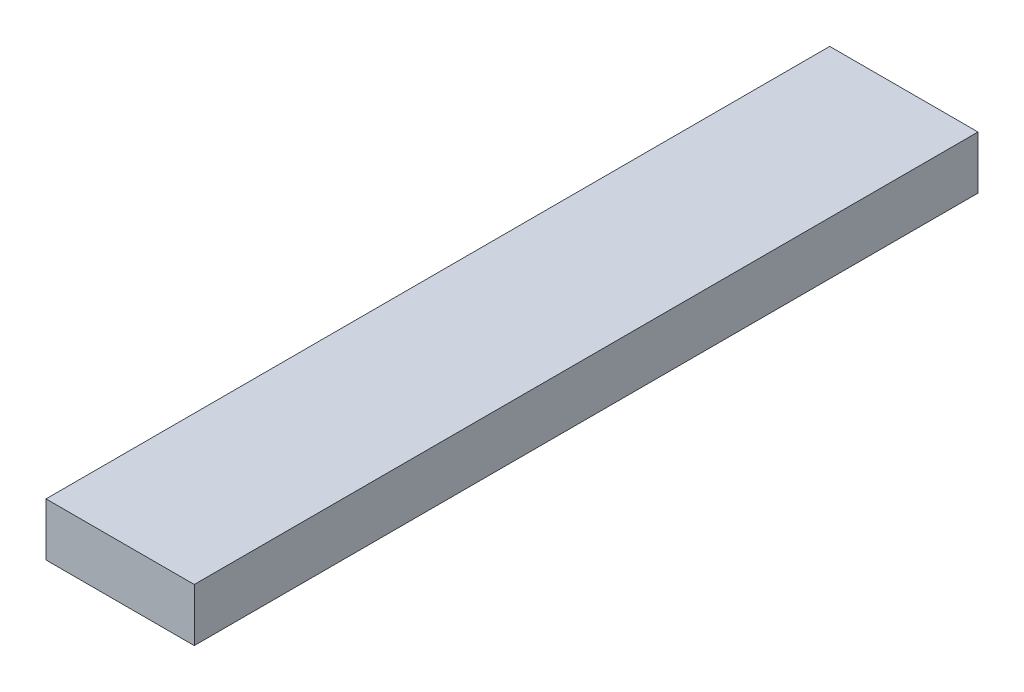
ISO-10303-21;
HEADER;
FILE_DESCRIPTION(('STEP AP214'),'2;1');
FILE_NAME('part.step','',(''),(''),'','','');
FILE_SCHEMA(('AUTOMOTIVE_DESIGN { 1 0 10303 214 1 1 1 1 }'));
ENDSEC;
DATA;
#1=APPLICATION_CONTEXT('core data for automotive mechanical design processes');
#2=APPLICATION_PROTOCOL_DEFINITION('international standard','automotive_design',2000,#1);
#3=PRODUCT_CONTEXT('',#1,'mechanical');
#4=PRODUCT('Part','Part','',(#3));
#5=PRODUCT_RELATED_PRODUCT_CATEGORY('part','',(#4));
#6=PRODUCT_DEFINITION_FORMATION('','',#4);
#7=PRODUCT_DEFINITION_CONTEXT('part definition',#1,'design');
#8=PRODUCT_DEFINITION('design','',#6,#7);
#9=PRODUCT_DEFINITION_SHAPE('','',#8);
#10=(LENGTH_UNIT() NAMED_UNIT(*) SI_UNIT(.MILLI.,.METRE.));
#11=(NAMED_UNIT(*) PLANE_ANGLE_UNIT() SI_UNIT($,.RADIAN.));
#12=(NAMED_UNIT(*) SI_UNIT($,.STERADIAN.) SOLID_ANGLE_UNIT());
#13=UNCERTAINTY_MEASURE_WITH_UNIT(LENGTH_MEASURE(1.E-05),#10,'distance_accuracy_value','');
#14=(GEOMETRIC_REPRESENTATION_CONTEXT(3) GLOBAL_UNCERTAINTY_ASSIGNED_CONTEXT((#13)) GLOBAL_UNIT_ASSIGNED_CONTEXT((#10,
#11,#12)) REPRESENTATION_CONTEXT('',''));
#15=CARTESIAN_POINT('',(0.,0.,0.));
#16=DIRECTION('',(0.,0.,1.));
#17=DIRECTION('',(1.,0.,0.));
#18=AXIS2_PLACEMENT_3D('',#15,#16,#17);
#19=CARTESIAN_POINT('',(0.,5.,0.));
#20=DIRECTION('',(1.,0.,0.));
#21=DIRECTION('',(0.,0.,-1.));
#22=AXIS2_PLACEMENT_3D('',#19,#20,#21);
#23=PLANE('',#22);
#24=DIRECTION('',(0.,0.,1.));
#25=VECTOR('',#24,1.);
#26=CARTESIAN_POINT('',(0.,0.,0.));
#27=LINE('',#26,#25);
#28=CARTESIAN_POINT('',(0.,0.,-74.));
#29=VERTEX_POINT('',#28);
#30=CARTESIAN_POINT('',(0.,0.,0.));
#31=VERTEX_POINT('',#30);
#32=EDGE_CURVE('E107',#29,#31,#27,.T.);
#33=ORIENTED_EDGE('',*,*,#32,.T.);
#34=DIRECTION('',(0.,-1.,0.));
#35=VECTOR('',#34,1.);
#36=CARTESIAN_POINT('',(0.,5.,0.));
#37=LINE('',#36,#35);
#38=CARTESIAN_POINT('',(0.,5.,0.));
#39=VERTEX_POINT('',#38);
#40=EDGE_CURVE('E11',#39,#31,#37,.T.);
#41=ORIENTED_EDGE('',*,*,#40,.F.);
#42=DIRECTION('',(0.,0.,1.));
#43=VECTOR('',#42,1.);
#44=CARTESIAN_POINT('',(0.,5.,0.));
#45=LINE('',#44,#43);
#46=CARTESIAN_POINT('',(0.,5.,-74.));
#47=VERTEX_POINT('',#46);
#48=EDGE_CURVE('E91',#47,#39,#45,.T.);
#49=ORIENTED_EDGE('',*,*,#48,.F.);
#50=DIRECTION('',(0.,-1.,0.));
#51=VECTOR('',#50,1.);
#52=CARTESIAN_POINT('',(0.,5.,-74.));
#53=LINE('',#52,#51);
#54=EDGE_CURVE('E103',#47,#29,#53,.T.);
#55=ORIENTED_EDGE('',*,*,#54,.T.);
#56=EDGE_LOOP('',(#33,#41,#49,#55));
#57=FACE_BOUND('',#56,.T.);
#58=ADVANCED_FACE('F39',(#57),#23,.F.);
#59=CARTESIAN_POINT('',(0.,5.,0.));
#60=DIRECTION('',(0.,0.,-1.));
#61=DIRECTION('',(-1.,0.,0.));
#62=AXIS2_PLACEMENT_3D('',#59,#60,#61);
#63=PLANE('',#62);
#64=DIRECTION('',(1.,0.,0.));
#65=VECTOR('',#64,1.);
#66=CARTESIAN_POINT('',(0.,0.,0.));
#67=LINE('',#66,#65);
#68=CARTESIAN_POINT('',(14.,0.,0.));
#69=VERTEX_POINT('',#68);
#70=EDGE_CURVE('E96',#31,#69,#67,.T.);
#71=ORIENTED_EDGE('',*,*,#70,.T.);
#72=DIRECTION('',(0.,-1.,0.));
#73=VECTOR('',#72,1.);
#74=CARTESIAN_POINT('',(14.,5.,0.));
#75=LINE('',#74,#73);
#76=CARTESIAN_POINT('',(14.,5.,0.));
#77=VERTEX_POINT('',#76);
#78=EDGE_CURVE('E48',#77,#69,#75,.T.);
#79=ORIENTED_EDGE('',*,*,#78,.F.);
#80=DIRECTION('',(1.,0.,0.));
#81=VECTOR('',#80,1.);
#82=CARTESIAN_POINT('',(0.,5.,0.));
#83=LINE('',#82,#81);
#84=EDGE_CURVE('E86',#39,#77,#83,.T.);
#85=ORIENTED_EDGE('',*,*,#84,.F.);
#86=ORIENTED_EDGE('',*,*,#40,.T.);
#87=EDGE_LOOP('',(#71,#79,#85,#86));
#88=FACE_BOUND('',#87,.T.);
#89=ADVANCED_FACE('F95',(#88),#63,.F.);
#90=CARTESIAN_POINT('',(14.,5.,0.));
#91=DIRECTION('',(-1.,0.,0.));
#92=DIRECTION('',(0.,0.,1.));
#93=AXIS2_PLACEMENT_3D('',#90,#91,#92);
#94=PLANE('',#93);
#95=DIRECTION('',(0.,0.,-1.));
#96=VECTOR('',#95,1.);
#97=CARTESIAN_POINT('',(14.,0.,0.));
#98=LINE('',#97,#96);
#99=CARTESIAN_POINT('',(14.,0.,-74.));
#100=VERTEX_POINT('',#99);
#101=EDGE_CURVE('E73',#69,#100,#98,.T.);
#102=ORIENTED_EDGE('',*,*,#101,.T.);
#103=DIRECTION('',(0.,-1.,0.));
#104=VECTOR('',#103,1.);
#105=CARTESIAN_POINT('',(14.,5.,-74.));
#106=LINE('',#105,#104);
#107=CARTESIAN_POINT('',(14.,5.,-74.));
#108=VERTEX_POINT('',#107);
#109=EDGE_CURVE('E98',#108,#100,#106,.T.);
#110=ORIENTED_EDGE('',*,*,#109,.F.);
#111=DIRECTION('',(0.,0.,-1.));
#112=VECTOR('',#111,1.);
#113=CARTESIAN_POINT('',(14.,5.,0.));
#114=LINE('',#113,#112);
#115=EDGE_CURVE('E89',#77,#108,#114,.T.);
#116=ORIENTED_EDGE('',*,*,#115,.F.);
#117=ORIENTED_EDGE('',*,*,#78,.T.);
#118=EDGE_LOOP('',(#102,#110,#116,#117));
#119=FACE_BOUND('',#118,.T.);
#120=ADVANCED_FACE('F99',(#119),#94,.F.);
#121=CARTESIAN_POINT('',(0.,5.,-74.));
#122=DIRECTION('',(0.,0.,1.));
#123=DIRECTION('',(1.,0.,0.));
#124=AXIS2_PLACEMENT_3D('',#121,#122,#123);
#125=PLANE('',#124);
#126=DIRECTION('',(-1.,0.,0.));
#127=VECTOR('',#126,1.);
#128=CARTESIAN_POINT('',(0.,0.,-74.));
#129=LINE('',#128,#127);
#130=EDGE_CURVE('E79',#100,#29,#129,.T.);
#131=ORIENTED_EDGE('',*,*,#130,.T.);
#132=ORIENTED_EDGE('',*,*,#54,.F.);
#133=DIRECTION('',(-1.,0.,0.));
#134=VECTOR('',#133,1.);
#135=CARTESIAN_POINT('',(0.,5.,-74.));
#136=LINE('',#135,#134);
#137=EDGE_CURVE('E56',#108,#47,#136,.T.);
#138=ORIENTED_EDGE('',*,*,#137,.F.);
#139=ORIENTED_EDGE('',*,*,#109,.T.);
#140=EDGE_LOOP('',(#131,#132,#138,#139));
#141=FACE_BOUND('',#140,.T.);
#142=ADVANCED_FACE('F120',(#141),#125,.F.);
#143=CARTESIAN_POINT('',(0.,5.,0.));
#144=DIRECTION('',(0.,-1.,0.));
#145=DIRECTION('',(0.,0.,-1.));
#146=AXIS2_PLACEMENT_3D('',#143,#144,#145);
#147=PLANE('',#146);
#148=ORIENTED_EDGE('',*,*,#48,.T.);
#149=ORIENTED_EDGE('',*,*,#84,.T.);
#150=ORIENTED_EDGE('',*,*,#115,.T.);
#151=ORIENTED_EDGE('',*,*,#137,.T.);
#152=EDGE_LOOP('',(#148,#149,#150,#151));
#153=FACE_BOUND('',#152,.T.);
#154=ADVANCED_FACE('F87',(#153),#147,.F.);
#155=CARTESIAN_POINT('',(0.,0.,0.));
#156=DIRECTION('',(0.,-1.,0.));
#157=DIRECTION('',(0.,0.,-1.));
#158=AXIS2_PLACEMENT_3D('',#155,#156,#157);
#159=PLANE('',#158);
#160=ORIENTED_EDGE('',*,*,#32,.F.);
#161=ORIENTED_EDGE('',*,*,#130,.F.);
#162=ORIENTED_EDGE('',*,*,#101,.F.);
#163=ORIENTED_EDGE('',*,*,#70,.F.);
#164=EDGE_LOOP('',(#160,#161,#162,#163));
#165=FACE_BOUND('',#164,.T.);
#166=ADVANCED_FACE('F123',(#165),#159,.T.);
#167=CLOSED_SHELL('',(#58,#89,#120,#142,#154,#166));
#168=MANIFOLD_SOLID_BREP('B2',#167);
#169=ADVANCED_BREP_SHAPE_REPRESENTATION('',(#18,#168),#14);
#170=SHAPE_DEFINITION_REPRESENTATION(#9,#169);
ENDSEC;
END-ISO-10303-21;
